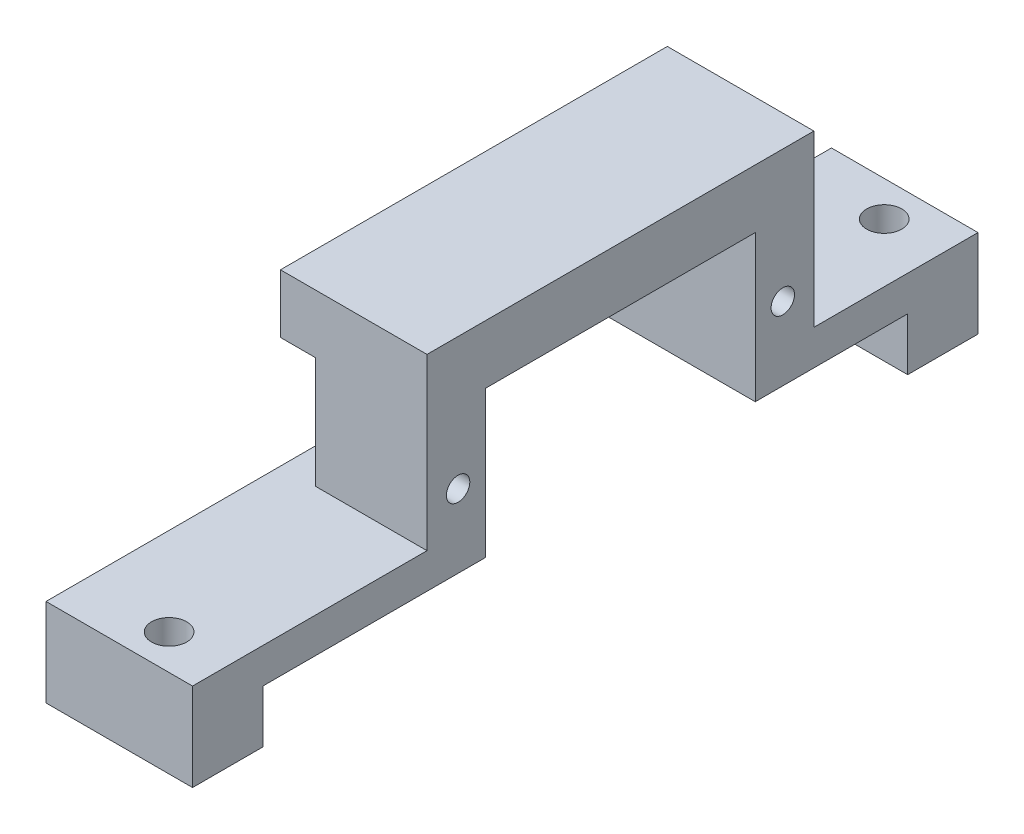
ISO-10303-21;
HEADER;
FILE_DESCRIPTION(('STEP AP214'),'2;1');
FILE_NAME('part.step','',(''),(''),'','','');
FILE_SCHEMA(('AUTOMOTIVE_DESIGN { 1 0 10303 214 1 1 1 1 }'));
ENDSEC;
DATA;
#1=APPLICATION_CONTEXT('core data for automotive mechanical design processes');
#2=APPLICATION_PROTOCOL_DEFINITION('international standard','automotive_design',2000,#1);
#3=PRODUCT_CONTEXT('',#1,'mechanical');
#4=PRODUCT('Part','Part','',(#3));
#5=PRODUCT_RELATED_PRODUCT_CATEGORY('part','',(#4));
#6=PRODUCT_DEFINITION_FORMATION('','',#4);
#7=PRODUCT_DEFINITION_CONTEXT('part definition',#1,'design');
#8=PRODUCT_DEFINITION('design','',#6,#7);
#9=PRODUCT_DEFINITION_SHAPE('','',#8);
#10=(LENGTH_UNIT() NAMED_UNIT(*) SI_UNIT(.MILLI.,.METRE.));
#11=(NAMED_UNIT(*) PLANE_ANGLE_UNIT() SI_UNIT($,.RADIAN.));
#12=(NAMED_UNIT(*) SI_UNIT($,.STERADIAN.) SOLID_ANGLE_UNIT());
#13=UNCERTAINTY_MEASURE_WITH_UNIT(LENGTH_MEASURE(1.E-05),#10,'distance_accuracy_value','');
#14=(GEOMETRIC_REPRESENTATION_CONTEXT(3) GLOBAL_UNCERTAINTY_ASSIGNED_CONTEXT((#13)) GLOBAL_UNIT_ASSIGNED_CONTEXT((#10,
#11,#12)) REPRESENTATION_CONTEXT('',''));
#15=CARTESIAN_POINT('',(0.,0.,0.));
#16=DIRECTION('',(0.,0.,1.));
#17=DIRECTION('',(1.,0.,0.));
#18=AXIS2_PLACEMENT_3D('',#15,#16,#17);
#19=CARTESIAN_POINT('',(0.,0.,0.));
#20=DIRECTION('',(1.,0.,0.));
#21=DIRECTION('',(0.,0.,-1.));
#22=AXIS2_PLACEMENT_3D('',#19,#20,#21);
#23=PLANE('',#22);
#24=DIRECTION('',(0.,0.,-1.));
#25=VECTOR('',#24,1.);
#26=CARTESIAN_POINT('',(0.,12.5,-25.));
#27=LINE('',#26,#25);
#28=CARTESIAN_POINT('',(0.,12.5,-20.));
#29=VERTEX_POINT('',#28);
#30=CARTESIAN_POINT('',(0.,12.5,-48.));
#31=VERTEX_POINT('',#30);
#32=EDGE_CURVE('E212',#29,#31,#27,.T.);
#33=ORIENTED_EDGE('',*,*,#32,.F.);
#34=DIRECTION('',(0.,-1.,0.));
#35=VECTOR('',#34,1.);
#36=CARTESIAN_POINT('',(0.,3.,-20.));
#37=LINE('',#36,#35);
#38=CARTESIAN_POINT('',(0.,17.5,-20.));
#39=VERTEX_POINT('',#38);
#40=EDGE_CURVE('E239',#39,#29,#37,.T.);
#41=ORIENTED_EDGE('',*,*,#40,.F.);
#42=DIRECTION('',(0.,0.,1.));
#43=VECTOR('',#42,1.);
#44=CARTESIAN_POINT('',(0.,17.5,-20.));
#45=LINE('',#44,#43);
#46=CARTESIAN_POINT('',(0.,17.5,-53.));
#47=VERTEX_POINT('',#46);
#48=EDGE_CURVE('E178',#47,#39,#45,.T.);
#49=ORIENTED_EDGE('',*,*,#48,.F.);
#50=DIRECTION('',(0.,1.,0.));
#51=VECTOR('',#50,1.);
#52=CARTESIAN_POINT('',(0.,17.5,-53.));
#53=LINE('',#52,#51);
#54=CARTESIAN_POINT('',(0.,3.,-53.));
#55=VERTEX_POINT('',#54);
#56=EDGE_CURVE('E234',#55,#47,#53,.T.);
#57=ORIENTED_EDGE('',*,*,#56,.F.);
#58=DIRECTION('',(0.,0.,1.));
#59=VECTOR('',#58,1.);
#60=CARTESIAN_POINT('',(0.,3.,-53.));
#61=LINE('',#60,#59);
#62=CARTESIAN_POINT('',(0.,3.,-67.));
#63=VERTEX_POINT('',#62);
#64=EDGE_CURVE('E231',#63,#55,#61,.T.);
#65=ORIENTED_EDGE('',*,*,#64,.F.);
#66=DIRECTION('',(0.,1.,0.));
#67=VECTOR('',#66,1.);
#68=CARTESIAN_POINT('',(0.,3.,-67.));
#69=LINE('',#68,#67);
#70=CARTESIAN_POINT('',(0.,-4.5,-67.));
#71=VERTEX_POINT('',#70);
#72=EDGE_CURVE('E228',#71,#63,#69,.T.);
#73=ORIENTED_EDGE('',*,*,#72,.F.);
#74=DIRECTION('',(0.,0.,-1.));
#75=VECTOR('',#74,1.);
#76=CARTESIAN_POINT('',(0.,-4.5,-61.));
#77=LINE('',#76,#75);
#78=CARTESIAN_POINT('',(0.,-4.5,-61.));
#79=VERTEX_POINT('',#78);
#80=EDGE_CURVE('E224',#79,#71,#77,.T.);
#81=ORIENTED_EDGE('',*,*,#80,.F.);
#82=DIRECTION('',(0.,-1.,0.));
#83=VECTOR('',#82,1.);
#84=CARTESIAN_POINT('',(0.,-4.5,-61.));
#85=LINE('',#84,#83);
#86=CARTESIAN_POINT('',(0.,0.,-61.));
#87=VERTEX_POINT('',#86);
#88=EDGE_CURVE('E221',#87,#79,#85,.T.);
#89=ORIENTED_EDGE('',*,*,#88,.F.);
#90=DIRECTION('',(0.,0.,-1.));
#91=VECTOR('',#90,1.);
#92=CARTESIAN_POINT('',(0.,0.,-48.));
#93=LINE('',#92,#91);
#94=CARTESIAN_POINT('',(0.,0.,-48.));
#95=VERTEX_POINT('',#94);
#96=EDGE_CURVE('E218',#95,#87,#93,.T.);
#97=ORIENTED_EDGE('',*,*,#96,.F.);
#98=DIRECTION('',(0.,-1.,0.));
#99=VECTOR('',#98,1.);
#100=CARTESIAN_POINT('',(0.,12.5,-48.));
#101=LINE('',#100,#99);
#102=EDGE_CURVE('E215',#31,#95,#101,.T.);
#103=ORIENTED_EDGE('',*,*,#102,.F.);
#104=EDGE_LOOP('',(#33,#41,#49,#57,#65,#73,#81,#89,#97,#103));
#105=FACE_BOUND('',#104,.T.);
#106=ADVANCED_FACE('F39',(#105),#23,.F.);
#107=CARTESIAN_POINT('',(12.5,-4.5,0.));
#108=DIRECTION('',(0.,1.,0.));
#109=DIRECTION('',(0.,0.,1.));
#110=AXIS2_PLACEMENT_3D('',#107,#108,#109);
#111=PLANE('',#110);
#112=CARTESIAN_POINT('',(7.5,-4.5,-3.));
#113=DIRECTION('',(0.,1.,0.));
#114=DIRECTION('',(0.,0.,1.));
#115=AXIS2_PLACEMENT_3D('',#112,#113,#114);
#116=CIRCLE('',#115,1.5);
#117=CARTESIAN_POINT('',(7.5,-4.5,-1.5));
#118=VERTEX_POINT('',#117);
#119=EDGE_CURVE('E495',#118,#118,#116,.T.);
#120=ORIENTED_EDGE('',*,*,#119,.T.);
#121=EDGE_LOOP('',(#120));
#122=FACE_BOUND('',#121,.T.);
#123=DIRECTION('',(0.,0.,-1.));
#124=VECTOR('',#123,1.);
#125=CARTESIAN_POINT('',(0.,-4.5,0.));
#126=LINE('',#125,#124);
#127=CARTESIAN_POINT('',(0.,-4.5,0.));
#128=VERTEX_POINT('',#127);
#129=CARTESIAN_POINT('',(0.,-4.5,-6.));
#130=VERTEX_POINT('',#129);
#131=EDGE_CURVE('E198',#128,#130,#126,.T.);
#132=ORIENTED_EDGE('',*,*,#131,.T.);
#133=DIRECTION('',(-1.,0.,0.));
#134=VECTOR('',#133,1.);
#135=CARTESIAN_POINT('',(12.5,-4.5,-6.));
#136=LINE('',#135,#134);
#137=CARTESIAN_POINT('',(12.5,-4.5,-6.));
#138=VERTEX_POINT('',#137);
#139=EDGE_CURVE('E48',#138,#130,#136,.T.);
#140=ORIENTED_EDGE('',*,*,#139,.F.);
#141=DIRECTION('',(0.,0.,-1.));
#142=VECTOR('',#141,1.);
#143=CARTESIAN_POINT('',(12.5,-4.5,0.));
#144=LINE('',#143,#142);
#145=CARTESIAN_POINT('',(12.5,-4.5,0.));
#146=VERTEX_POINT('',#145);
#147=EDGE_CURVE('E120',#146,#138,#144,.T.);
#148=ORIENTED_EDGE('',*,*,#147,.F.);
#149=DIRECTION('',(-1.,0.,0.));
#150=VECTOR('',#149,1.);
#151=CARTESIAN_POINT('',(12.5,-4.5,0.));
#152=LINE('',#151,#150);
#153=EDGE_CURVE('E11',#146,#128,#152,.T.);
#154=ORIENTED_EDGE('',*,*,#153,.T.);
#155=EDGE_LOOP('',(#132,#140,#148,#154));
#156=FACE_BOUND('',#155,.T.);
#157=ADVANCED_FACE('F41',(#122,#156),#111,.F.);
#158=CARTESIAN_POINT('',(12.5,-4.5,-6.));
#159=DIRECTION('',(0.,0.,1.));
#160=DIRECTION('',(1.,0.,0.));
#161=AXIS2_PLACEMENT_3D('',#158,#159,#160);
#162=PLANE('',#161);
#163=DIRECTION('',(0.,1.,0.));
#164=VECTOR('',#163,1.);
#165=CARTESIAN_POINT('',(0.,-4.5,-6.));
#166=LINE('',#165,#164);
#167=CARTESIAN_POINT('',(0.,0.,-6.));
#168=VERTEX_POINT('',#167);
#169=EDGE_CURVE('E201',#130,#168,#166,.T.);
#170=ORIENTED_EDGE('',*,*,#169,.T.);
#171=DIRECTION('',(-1.,0.,0.));
#172=VECTOR('',#171,1.);
#173=CARTESIAN_POINT('',(12.5,0.,-6.));
#174=LINE('',#173,#172);
#175=CARTESIAN_POINT('',(12.5,0.,-6.));
#176=VERTEX_POINT('',#175);
#177=EDGE_CURVE('E289',#176,#168,#174,.T.);
#178=ORIENTED_EDGE('',*,*,#177,.F.);
#179=DIRECTION('',(0.,1.,0.));
#180=VECTOR('',#179,1.);
#181=CARTESIAN_POINT('',(12.5,-4.5,-6.));
#182=LINE('',#181,#180);
#183=EDGE_CURVE('E299',#138,#176,#182,.T.);
#184=ORIENTED_EDGE('',*,*,#183,.F.);
#185=ORIENTED_EDGE('',*,*,#139,.T.);
#186=EDGE_LOOP('',(#170,#178,#184,#185));
#187=FACE_BOUND('',#186,.T.);
#188=ADVANCED_FACE('F297',(#187),#162,.F.);
#189=CARTESIAN_POINT('',(12.5,0.,-6.));
#190=DIRECTION('',(0.,1.,0.));
#191=DIRECTION('',(0.,0.,1.));
#192=AXIS2_PLACEMENT_3D('',#189,#190,#191);
#193=PLANE('',#192);
#194=DIRECTION('',(0.,0.,-1.));
#195=VECTOR('',#194,1.);
#196=CARTESIAN_POINT('',(0.,0.,-6.));
#197=LINE('',#196,#195);
#198=CARTESIAN_POINT('',(0.,0.,-25.));
#199=VERTEX_POINT('',#198);
#200=EDGE_CURVE('E205',#168,#199,#197,.T.);
#201=ORIENTED_EDGE('',*,*,#200,.T.);
#202=DIRECTION('',(-1.,0.,0.));
#203=VECTOR('',#202,1.);
#204=CARTESIAN_POINT('',(12.5,0.,-25.));
#205=LINE('',#204,#203);
#206=CARTESIAN_POINT('',(12.5,0.,-25.));
#207=VERTEX_POINT('',#206);
#208=EDGE_CURVE('E285',#207,#199,#205,.T.);
#209=ORIENTED_EDGE('',*,*,#208,.F.);
#210=DIRECTION('',(0.,0.,-1.));
#211=VECTOR('',#210,1.);
#212=CARTESIAN_POINT('',(12.5,0.,-6.));
#213=LINE('',#212,#211);
#214=EDGE_CURVE('E317',#176,#207,#213,.T.);
#215=ORIENTED_EDGE('',*,*,#214,.F.);
#216=ORIENTED_EDGE('',*,*,#177,.T.);
#217=EDGE_LOOP('',(#201,#209,#215,#216));
#218=FACE_BOUND('',#217,.T.);
#219=ADVANCED_FACE('F305',(#218),#193,.F.);
#220=CARTESIAN_POINT('',(12.5,0.,-25.));
#221=DIRECTION('',(0.,0.,1.));
#222=DIRECTION('',(0.,-1.,0.));
#223=AXIS2_PLACEMENT_3D('',#220,#221,#222);
#224=PLANE('',#223);
#225=DIRECTION('',(1.,0.,0.));
#226=VECTOR('',#225,1.);
#227=CARTESIAN_POINT('',(0.,3.,-25.));
#228=LINE('',#227,#226);
#229=CARTESIAN_POINT('',(0.,3.,-25.));
#230=VERTEX_POINT('',#229);
#231=CARTESIAN_POINT('',(3.,3.,-25.));
#232=VERTEX_POINT('',#231);
#233=EDGE_CURVE('E381',#230,#232,#228,.T.);
#234=ORIENTED_EDGE('',*,*,#233,.T.);
#235=DIRECTION('',(0.,1.,0.));
#236=VECTOR('',#235,1.);
#237=CARTESIAN_POINT('',(3.,3.,-25.));
#238=LINE('',#237,#236);
#239=CARTESIAN_POINT('',(3.,12.5,-25.));
#240=VERTEX_POINT('',#239);
#241=EDGE_CURVE('E375',#232,#240,#238,.T.);
#242=ORIENTED_EDGE('',*,*,#241,.T.);
#243=DIRECTION('',(-1.,0.,0.));
#244=VECTOR('',#243,1.);
#245=CARTESIAN_POINT('',(12.5,12.5,-25.));
#246=LINE('',#245,#244);
#247=CARTESIAN_POINT('',(12.5,12.5,-25.));
#248=VERTEX_POINT('',#247);
#249=EDGE_CURVE('E281',#248,#240,#246,.T.);
#250=ORIENTED_EDGE('',*,*,#249,.F.);
#251=DIRECTION('',(0.,1.,0.));
#252=VECTOR('',#251,1.);
#253=CARTESIAN_POINT('',(12.5,0.,-25.));
#254=LINE('',#253,#252);
#255=EDGE_CURVE('E312',#207,#248,#254,.T.);
#256=ORIENTED_EDGE('',*,*,#255,.F.);
#257=ORIENTED_EDGE('',*,*,#208,.T.);
#258=DIRECTION('',(0.,1.,0.));
#259=VECTOR('',#258,1.);
#260=CARTESIAN_POINT('',(0.,0.,-25.));
#261=LINE('',#260,#259);
#262=EDGE_CURVE('E208',#199,#230,#261,.T.);
#263=ORIENTED_EDGE('',*,*,#262,.T.);
#264=EDGE_LOOP('',(#234,#242,#250,#256,#257,#263));
#265=FACE_BOUND('',#264,.T.);
#266=ADVANCED_FACE('F310',(#265),#224,.F.);
#267=CARTESIAN_POINT('',(12.5,12.5,-25.));
#268=DIRECTION('',(0.,1.,0.));
#269=DIRECTION('',(0.,0.,1.));
#270=AXIS2_PLACEMENT_3D('',#267,#268,#269);
#271=PLANE('',#270);
#272=ORIENTED_EDGE('',*,*,#32,.T.);
#273=DIRECTION('',(-1.,0.,0.));
#274=VECTOR('',#273,1.);
#275=CARTESIAN_POINT('',(12.5,12.5,-48.));
#276=LINE('',#275,#274);
#277=CARTESIAN_POINT('',(12.5,12.5,-48.));
#278=VERTEX_POINT('',#277);
#279=EDGE_CURVE('E277',#278,#31,#276,.T.);
#280=ORIENTED_EDGE('',*,*,#279,.F.);
#281=DIRECTION('',(0.,0.,-1.));
#282=VECTOR('',#281,1.);
#283=CARTESIAN_POINT('',(12.5,12.5,-25.));
#284=LINE('',#283,#282);
#285=EDGE_CURVE('E316',#248,#278,#284,.T.);
#286=ORIENTED_EDGE('',*,*,#285,.F.);
#287=ORIENTED_EDGE('',*,*,#249,.T.);
#288=DIRECTION('',(0.,0.,1.));
#289=VECTOR('',#288,1.);
#290=CARTESIAN_POINT('',(3.,12.5,-25.));
#291=LINE('',#290,#289);
#292=CARTESIAN_POINT('',(3.,12.5,-20.));
#293=VERTEX_POINT('',#292);
#294=EDGE_CURVE('E367',#240,#293,#291,.T.);
#295=ORIENTED_EDGE('',*,*,#294,.T.);
#296=DIRECTION('',(-1.,0.,0.));
#297=VECTOR('',#296,1.);
#298=CARTESIAN_POINT('',(0.,12.5,-20.));
#299=LINE('',#298,#297);
#300=EDGE_CURVE('E359',#293,#29,#299,.T.);
#301=ORIENTED_EDGE('',*,*,#300,.T.);
#302=EDGE_LOOP('',(#272,#280,#286,#287,#295,#301));
#303=FACE_BOUND('',#302,.T.);
#304=ADVANCED_FACE('F384',(#303),#271,.F.);
#305=CARTESIAN_POINT('',(12.5,12.5,-48.));
#306=DIRECTION('',(0.,0.,-1.));
#307=DIRECTION('',(-1.,0.,0.));
#308=AXIS2_PLACEMENT_3D('',#305,#306,#307);
#309=PLANE('',#308);
#310=ORIENTED_EDGE('',*,*,#102,.T.);
#311=DIRECTION('',(-1.,0.,0.));
#312=VECTOR('',#311,1.);
#313=CARTESIAN_POINT('',(12.5,0.,-48.));
#314=LINE('',#313,#312);
#315=CARTESIAN_POINT('',(12.5,0.,-48.));
#316=VERTEX_POINT('',#315);
#317=EDGE_CURVE('E273',#316,#95,#314,.T.);
#318=ORIENTED_EDGE('',*,*,#317,.F.);
#319=DIRECTION('',(0.,-1.,0.));
#320=VECTOR('',#319,1.);
#321=CARTESIAN_POINT('',(12.5,12.5,-48.));
#322=LINE('',#321,#320);
#323=EDGE_CURVE('E321',#278,#316,#322,.T.);
#324=ORIENTED_EDGE('',*,*,#323,.F.);
#325=ORIENTED_EDGE('',*,*,#279,.T.);
#326=EDGE_LOOP('',(#310,#318,#324,#325));
#327=FACE_BOUND('',#326,.T.);
#328=ADVANCED_FACE('F391',(#327),#309,.F.);
#329=CARTESIAN_POINT('',(12.5,0.,-48.));
#330=DIRECTION('',(0.,1.,0.));
#331=DIRECTION('',(0.,0.,1.));
#332=AXIS2_PLACEMENT_3D('',#329,#330,#331);
#333=PLANE('',#332);
#334=ORIENTED_EDGE('',*,*,#96,.T.);
#335=DIRECTION('',(-1.,0.,0.));
#336=VECTOR('',#335,1.);
#337=CARTESIAN_POINT('',(12.5,0.,-61.));
#338=LINE('',#337,#336);
#339=CARTESIAN_POINT('',(12.5,0.,-61.));
#340=VERTEX_POINT('',#339);
#341=EDGE_CURVE('E269',#340,#87,#338,.T.);
#342=ORIENTED_EDGE('',*,*,#341,.F.);
#343=DIRECTION('',(0.,0.,-1.));
#344=VECTOR('',#343,1.);
#345=CARTESIAN_POINT('',(12.5,0.,-48.));
#346=LINE('',#345,#344);
#347=EDGE_CURVE('E328',#316,#340,#346,.T.);
#348=ORIENTED_EDGE('',*,*,#347,.F.);
#349=ORIENTED_EDGE('',*,*,#317,.T.);
#350=EDGE_LOOP('',(#334,#342,#348,#349));
#351=FACE_BOUND('',#350,.T.);
#352=ADVANCED_FACE('F394',(#351),#333,.F.);
#353=CARTESIAN_POINT('',(12.5,-4.5,-61.));
#354=DIRECTION('',(0.,0.,-1.));
#355=DIRECTION('',(-1.,0.,0.));
#356=AXIS2_PLACEMENT_3D('',#353,#354,#355);
#357=PLANE('',#356);
#358=ORIENTED_EDGE('',*,*,#88,.T.);
#359=DIRECTION('',(-1.,0.,0.));
#360=VECTOR('',#359,1.);
#361=CARTESIAN_POINT('',(12.5,-4.5,-61.));
#362=LINE('',#361,#360);
#363=CARTESIAN_POINT('',(12.5,-4.5,-61.));
#364=VERTEX_POINT('',#363);
#365=EDGE_CURVE('E265',#364,#79,#362,.T.);
#366=ORIENTED_EDGE('',*,*,#365,.F.);
#367=DIRECTION('',(0.,-1.,0.));
#368=VECTOR('',#367,1.);
#369=CARTESIAN_POINT('',(12.5,-4.5,-61.));
#370=LINE('',#369,#368);
#371=EDGE_CURVE('E331',#340,#364,#370,.T.);
#372=ORIENTED_EDGE('',*,*,#371,.F.);
#373=ORIENTED_EDGE('',*,*,#341,.T.);
#374=EDGE_LOOP('',(#358,#366,#372,#373));
#375=FACE_BOUND('',#374,.T.);
#376=ADVANCED_FACE('F399',(#375),#357,.F.);
#377=CARTESIAN_POINT('',(12.5,-4.5,-61.));
#378=DIRECTION('',(0.,1.,0.));
#379=DIRECTION('',(0.,0.,1.));
#380=AXIS2_PLACEMENT_3D('',#377,#378,#379);
#381=PLANE('',#380);
#382=CARTESIAN_POINT('',(7.5,-4.5,-64.));
#383=DIRECTION('',(0.,1.,0.));
#384=DIRECTION('',(0.,0.,1.));
#385=AXIS2_PLACEMENT_3D('',#382,#383,#384);
#386=CIRCLE('',#385,1.5);
#387=CARTESIAN_POINT('',(7.5,-4.5,-62.5));
#388=VERTEX_POINT('',#387);
#389=EDGE_CURVE('E202',#388,#388,#386,.T.);
#390=ORIENTED_EDGE('',*,*,#389,.T.);
#391=EDGE_LOOP('',(#390));
#392=FACE_BOUND('',#391,.T.);
#393=ORIENTED_EDGE('',*,*,#80,.T.);
#394=DIRECTION('',(-1.,0.,0.));
#395=VECTOR('',#394,1.);
#396=CARTESIAN_POINT('',(12.5,-4.5,-67.));
#397=LINE('',#396,#395);
#398=CARTESIAN_POINT('',(12.5,-4.5,-67.));
#399=VERTEX_POINT('',#398);
#400=EDGE_CURVE('E261',#399,#71,#397,.T.);
#401=ORIENTED_EDGE('',*,*,#400,.F.);
#402=DIRECTION('',(0.,0.,-1.));
#403=VECTOR('',#402,1.);
#404=CARTESIAN_POINT('',(12.5,-4.5,-61.));
#405=LINE('',#404,#403);
#406=EDGE_CURVE('E334',#364,#399,#405,.T.);
#407=ORIENTED_EDGE('',*,*,#406,.F.);
#408=ORIENTED_EDGE('',*,*,#365,.T.);
#409=EDGE_LOOP('',(#393,#401,#407,#408));
#410=FACE_BOUND('',#409,.T.);
#411=ADVANCED_FACE('F403',(#392,#410),#381,.F.);
#412=CARTESIAN_POINT('',(12.5,3.,-67.));
#413=DIRECTION('',(0.,0.,1.));
#414=DIRECTION('',(1.,0.,0.));
#415=AXIS2_PLACEMENT_3D('',#412,#413,#414);
#416=PLANE('',#415);
#417=ORIENTED_EDGE('',*,*,#72,.T.);
#418=DIRECTION('',(-1.,0.,0.));
#419=VECTOR('',#418,1.);
#420=CARTESIAN_POINT('',(12.5,3.,-67.));
#421=LINE('',#420,#419);
#422=CARTESIAN_POINT('',(12.5,3.,-67.));
#423=VERTEX_POINT('',#422);
#424=EDGE_CURVE('E257',#423,#63,#421,.T.);
#425=ORIENTED_EDGE('',*,*,#424,.F.);
#426=DIRECTION('',(0.,1.,0.));
#427=VECTOR('',#426,1.);
#428=CARTESIAN_POINT('',(12.5,-4.5,-67.));
#429=LINE('',#428,#427);
#430=EDGE_CURVE('E337',#399,#423,#429,.T.);
#431=ORIENTED_EDGE('',*,*,#430,.F.);
#432=ORIENTED_EDGE('',*,*,#400,.T.);
#433=EDGE_LOOP('',(#417,#425,#431,#432));
#434=FACE_BOUND('',#433,.T.);
#435=ADVANCED_FACE('F406',(#434),#416,.F.);
#436=CARTESIAN_POINT('',(12.5,3.,-53.));
#437=DIRECTION('',(0.,-1.,0.));
#438=DIRECTION('',(0.,0.,-1.));
#439=AXIS2_PLACEMENT_3D('',#436,#437,#438);
#440=PLANE('',#439);
#441=CARTESIAN_POINT('',(7.5,3.,-64.));
#442=DIRECTION('',(0.,1.,0.));
#443=DIRECTION('',(0.,0.,-1.));
#444=AXIS2_PLACEMENT_3D('',#441,#442,#443);
#445=CIRCLE('',#444,1.5);
#446=CARTESIAN_POINT('',(7.5,3.,-65.5));
#447=VERTEX_POINT('',#446);
#448=EDGE_CURVE('E378',#447,#447,#445,.T.);
#449=ORIENTED_EDGE('',*,*,#448,.F.);
#450=EDGE_LOOP('',(#449));
#451=FACE_BOUND('',#450,.T.);
#452=ORIENTED_EDGE('',*,*,#64,.T.);
#453=DIRECTION('',(-1.,0.,0.));
#454=VECTOR('',#453,1.);
#455=CARTESIAN_POINT('',(12.5,3.,-53.));
#456=LINE('',#455,#454);
#457=CARTESIAN_POINT('',(12.5,3.,-53.));
#458=VERTEX_POINT('',#457);
#459=EDGE_CURVE('E253',#458,#55,#456,.T.);
#460=ORIENTED_EDGE('',*,*,#459,.F.);
#461=DIRECTION('',(0.,0.,1.));
#462=VECTOR('',#461,1.);
#463=CARTESIAN_POINT('',(12.5,3.,-53.));
#464=LINE('',#463,#462);
#465=EDGE_CURVE('E340',#423,#458,#464,.T.);
#466=ORIENTED_EDGE('',*,*,#465,.F.);
#467=ORIENTED_EDGE('',*,*,#424,.T.);
#468=EDGE_LOOP('',(#452,#460,#466,#467));
#469=FACE_BOUND('',#468,.T.);
#470=ADVANCED_FACE('F348',(#451,#469),#440,.F.);
#471=CARTESIAN_POINT('',(12.5,17.5,-53.));
#472=DIRECTION('',(0.,0.,1.));
#473=DIRECTION('',(1.,0.,0.));
#474=AXIS2_PLACEMENT_3D('',#471,#472,#473);
#475=PLANE('',#474);
#476=ORIENTED_EDGE('',*,*,#56,.T.);
#477=DIRECTION('',(-1.,0.,0.));
#478=VECTOR('',#477,1.);
#479=CARTESIAN_POINT('',(12.5,17.5,-53.));
#480=LINE('',#479,#478);
#481=CARTESIAN_POINT('',(12.5,17.5,-53.));
#482=VERTEX_POINT('',#481);
#483=EDGE_CURVE('E183',#482,#47,#480,.T.);
#484=ORIENTED_EDGE('',*,*,#483,.F.);
#485=DIRECTION('',(0.,1.,0.));
#486=VECTOR('',#485,1.);
#487=CARTESIAN_POINT('',(12.5,17.5,-53.));
#488=LINE('',#487,#486);
#489=EDGE_CURVE('E168',#458,#482,#488,.T.);
#490=ORIENTED_EDGE('',*,*,#489,.F.);
#491=ORIENTED_EDGE('',*,*,#459,.T.);
#492=EDGE_LOOP('',(#476,#484,#490,#491));
#493=FACE_BOUND('',#492,.T.);
#494=ADVANCED_FACE('F352',(#493),#475,.F.);
#495=CARTESIAN_POINT('',(12.5,17.5,-20.));
#496=DIRECTION('',(0.,-1.,0.));
#497=DIRECTION('',(0.,0.,-1.));
#498=AXIS2_PLACEMENT_3D('',#495,#496,#497);
#499=PLANE('',#498);
#500=ORIENTED_EDGE('',*,*,#48,.T.);
#501=DIRECTION('',(-1.,0.,0.));
#502=VECTOR('',#501,1.);
#503=CARTESIAN_POINT('',(12.5,17.5,-20.));
#504=LINE('',#503,#502);
#505=CARTESIAN_POINT('',(12.5,17.5,-20.));
#506=VERTEX_POINT('',#505);
#507=EDGE_CURVE('E175',#506,#39,#504,.T.);
#508=ORIENTED_EDGE('',*,*,#507,.F.);
#509=DIRECTION('',(0.,0.,1.));
#510=VECTOR('',#509,1.);
#511=CARTESIAN_POINT('',(12.5,17.5,-20.));
#512=LINE('',#511,#510);
#513=EDGE_CURVE('E161',#482,#506,#512,.T.);
#514=ORIENTED_EDGE('',*,*,#513,.F.);
#515=ORIENTED_EDGE('',*,*,#483,.T.);
#516=EDGE_LOOP('',(#500,#508,#514,#515));
#517=FACE_BOUND('',#516,.T.);
#518=ADVANCED_FACE('F176',(#517),#499,.F.);
#519=CARTESIAN_POINT('',(12.5,3.,-20.));
#520=DIRECTION('',(0.,0.,-1.));
#521=DIRECTION('',(-1.,0.,0.));
#522=AXIS2_PLACEMENT_3D('',#519,#520,#521);
#523=PLANE('',#522);
#524=ORIENTED_EDGE('',*,*,#40,.T.);
#525=ORIENTED_EDGE('',*,*,#300,.F.);
#526=DIRECTION('',(0.,1.,0.));
#527=VECTOR('',#526,1.);
#528=CARTESIAN_POINT('',(3.,3.,-20.));
#529=LINE('',#528,#527);
#530=CARTESIAN_POINT('',(3.,3.,-20.));
#531=VERTEX_POINT('',#530);
#532=EDGE_CURVE('E376',#531,#293,#529,.T.);
#533=ORIENTED_EDGE('',*,*,#532,.F.);
#534=DIRECTION('',(-1.,0.,0.));
#535=VECTOR('',#534,1.);
#536=CARTESIAN_POINT('',(12.5,3.,-20.));
#537=LINE('',#536,#535);
#538=CARTESIAN_POINT('',(12.5,3.,-20.));
#539=VERTEX_POINT('',#538);
#540=EDGE_CURVE('E184',#539,#531,#537,.T.);
#541=ORIENTED_EDGE('',*,*,#540,.F.);
#542=DIRECTION('',(0.,-1.,0.));
#543=VECTOR('',#542,1.);
#544=CARTESIAN_POINT('',(12.5,3.,-20.));
#545=LINE('',#544,#543);
#546=EDGE_CURVE('E165',#506,#539,#545,.T.);
#547=ORIENTED_EDGE('',*,*,#546,.F.);
#548=ORIENTED_EDGE('',*,*,#507,.T.);
#549=EDGE_LOOP('',(#524,#525,#533,#541,#547,#548));
#550=FACE_BOUND('',#549,.T.);
#551=ADVANCED_FACE('F186',(#550),#523,.F.);
#552=CARTESIAN_POINT('',(12.5,3.,0.));
#553=DIRECTION('',(0.,-1.,0.));
#554=DIRECTION('',(0.,0.,-1.));
#555=AXIS2_PLACEMENT_3D('',#552,#553,#554);
#556=PLANE('',#555);
#557=CARTESIAN_POINT('',(7.5,3.,-3.));
#558=DIRECTION('',(0.,1.,0.));
#559=DIRECTION('',(0.,0.,1.));
#560=AXIS2_PLACEMENT_3D('',#557,#558,#559);
#561=CIRCLE('',#560,1.5);
#562=CARTESIAN_POINT('',(7.5,3.,-1.5));
#563=VERTEX_POINT('',#562);
#564=EDGE_CURVE('E491',#563,#563,#561,.T.);
#565=ORIENTED_EDGE('',*,*,#564,.F.);
#566=EDGE_LOOP('',(#565));
#567=FACE_BOUND('',#566,.T.);
#568=DIRECTION('',(0.,0.,1.));
#569=VECTOR('',#568,1.);
#570=CARTESIAN_POINT('',(0.,3.,0.));
#571=LINE('',#570,#569);
#572=CARTESIAN_POINT('',(0.,3.,0.));
#573=VERTEX_POINT('',#572);
#574=EDGE_CURVE('E55',#230,#573,#571,.T.);
#575=ORIENTED_EDGE('',*,*,#574,.T.);
#576=DIRECTION('',(-1.,0.,0.));
#577=VECTOR('',#576,1.);
#578=CARTESIAN_POINT('',(12.5,3.,0.));
#579=LINE('',#578,#577);
#580=CARTESIAN_POINT('',(12.5,3.,0.));
#581=VERTEX_POINT('',#580);
#582=EDGE_CURVE('E194',#581,#573,#579,.T.);
#583=ORIENTED_EDGE('',*,*,#582,.F.);
#584=DIRECTION('',(0.,0.,1.));
#585=VECTOR('',#584,1.);
#586=CARTESIAN_POINT('',(12.5,3.,0.));
#587=LINE('',#586,#585);
#588=EDGE_CURVE('E191',#539,#581,#587,.T.);
#589=ORIENTED_EDGE('',*,*,#588,.F.);
#590=ORIENTED_EDGE('',*,*,#540,.T.);
#591=DIRECTION('',(0.,0.,1.));
#592=VECTOR('',#591,1.);
#593=CARTESIAN_POINT('',(3.,3.,-25.));
#594=LINE('',#593,#592);
#595=EDGE_CURVE('E379',#232,#531,#594,.T.);
#596=ORIENTED_EDGE('',*,*,#595,.F.);
#597=ORIENTED_EDGE('',*,*,#233,.F.);
#598=EDGE_LOOP('',(#575,#583,#589,#590,#596,#597));
#599=FACE_BOUND('',#598,.T.);
#600=ADVANCED_FACE('F439',(#567,#599),#556,.F.);
#601=CARTESIAN_POINT('',(12.5,3.,0.));
#602=DIRECTION('',(0.,0.,-1.));
#603=DIRECTION('',(-1.,0.,0.));
#604=AXIS2_PLACEMENT_3D('',#601,#602,#603);
#605=PLANE('',#604);
#606=DIRECTION('',(0.,-1.,0.));
#607=VECTOR('',#606,1.);
#608=CARTESIAN_POINT('',(0.,3.,0.));
#609=LINE('',#608,#607);
#610=EDGE_CURVE('E244',#573,#128,#609,.T.);
#611=ORIENTED_EDGE('',*,*,#610,.T.);
#612=ORIENTED_EDGE('',*,*,#153,.F.);
#613=DIRECTION('',(0.,-1.,0.));
#614=VECTOR('',#613,1.);
#615=CARTESIAN_POINT('',(12.5,0.,0.));
#616=LINE('',#615,#614);
#617=EDGE_CURVE('E64',#581,#146,#616,.T.);
#618=ORIENTED_EDGE('',*,*,#617,.F.);
#619=ORIENTED_EDGE('',*,*,#582,.T.);
#620=EDGE_LOOP('',(#611,#612,#618,#619));
#621=FACE_BOUND('',#620,.T.);
#622=ADVANCED_FACE('F434',(#621),#605,.F.);
#623=CARTESIAN_POINT('',(12.5,0.,0.));
#624=DIRECTION('',(1.,0.,0.));
#625=DIRECTION('',(0.,0.,-1.));
#626=AXIS2_PLACEMENT_3D('',#623,#624,#625);
#627=PLANE('',#626);
#628=CARTESIAN_POINT('',(12.5,6.25,-22.65));
#629=DIRECTION('',(1.,0.,0.));
#630=DIRECTION('',(0.,0.,-1.));
#631=AXIS2_PLACEMENT_3D('',#628,#629,#630);
#632=CIRCLE('',#631,1.);
#633=CARTESIAN_POINT('',(12.5,6.25,-23.65));
#634=VERTEX_POINT('',#633);
#635=EDGE_CURVE('E469',#634,#634,#632,.T.);
#636=ORIENTED_EDGE('',*,*,#635,.F.);
#637=EDGE_LOOP('',(#636));
#638=FACE_BOUND('',#637,.T.);
#639=CARTESIAN_POINT('',(12.5,6.25,-50.35));
#640=DIRECTION('',(1.,0.,0.));
#641=DIRECTION('',(0.,0.,1.));
#642=AXIS2_PLACEMENT_3D('',#639,#640,#641);
#643=CIRCLE('',#642,0.999999999999998);
#644=CARTESIAN_POINT('',(12.5,6.25,-49.35));
#645=VERTEX_POINT('',#644);
#646=EDGE_CURVE('E481',#645,#645,#643,.T.);
#647=ORIENTED_EDGE('',*,*,#646,.F.);
#648=EDGE_LOOP('',(#647));
#649=FACE_BOUND('',#648,.T.);
#650=ORIENTED_EDGE('',*,*,#617,.T.);
#651=ORIENTED_EDGE('',*,*,#147,.T.);
#652=ORIENTED_EDGE('',*,*,#183,.T.);
#653=ORIENTED_EDGE('',*,*,#214,.T.);
#654=ORIENTED_EDGE('',*,*,#255,.T.);
#655=ORIENTED_EDGE('',*,*,#285,.T.);
#656=ORIENTED_EDGE('',*,*,#323,.T.);
#657=ORIENTED_EDGE('',*,*,#347,.T.);
#658=ORIENTED_EDGE('',*,*,#371,.T.);
#659=ORIENTED_EDGE('',*,*,#406,.T.);
#660=ORIENTED_EDGE('',*,*,#430,.T.);
#661=ORIENTED_EDGE('',*,*,#465,.T.);
#662=ORIENTED_EDGE('',*,*,#489,.T.);
#663=ORIENTED_EDGE('',*,*,#513,.T.);
#664=ORIENTED_EDGE('',*,*,#546,.T.);
#665=ORIENTED_EDGE('',*,*,#588,.T.);
#666=EDGE_LOOP('',(#650,#651,#652,#653,#654,#655,#656,#657,#658,#659,#660,#661,#662,#663,#664,#665));
#667=FACE_BOUND('',#666,.T.);
#668=ADVANCED_FACE('F163',(#638,#649,#667),#627,.T.);
#669=ORIENTED_EDGE('',*,*,#574,.F.);
#670=ORIENTED_EDGE('',*,*,#262,.F.);
#671=ORIENTED_EDGE('',*,*,#200,.F.);
#672=ORIENTED_EDGE('',*,*,#169,.F.);
#673=ORIENTED_EDGE('',*,*,#131,.F.);
#674=ORIENTED_EDGE('',*,*,#610,.F.);
#675=EDGE_LOOP('',(#669,#670,#671,#672,#673,#674));
#676=FACE_BOUND('',#675,.T.);
#677=ADVANCED_FACE('F302',(#676),#23,.F.);
#678=CARTESIAN_POINT('',(7.5,-9.5,-3.));
#679=DIRECTION('',(0.,1.,0.));
#680=DIRECTION('',(0.,0.,1.));
#681=AXIS2_PLACEMENT_3D('',#678,#679,#680);
#682=CYLINDRICAL_SURFACE('',#681,1.5);
#683=ORIENTED_EDGE('',*,*,#564,.T.);
#684=EDGE_LOOP('',(#683));
#685=FACE_BOUND('',#684,.T.);
#686=ORIENTED_EDGE('',*,*,#119,.F.);
#687=EDGE_LOOP('',(#686));
#688=FACE_BOUND('',#687,.T.);
#689=ADVANCED_FACE('F426',(#685,#688),#682,.F.);
#690=CARTESIAN_POINT('',(7.5,-9.5,-64.));
#691=DIRECTION('',(0.,1.,0.));
#692=DIRECTION('',(0.,0.,1.));
#693=AXIS2_PLACEMENT_3D('',#690,#691,#692);
#694=CYLINDRICAL_SURFACE('',#693,1.5);
#695=ORIENTED_EDGE('',*,*,#448,.T.);
#696=EDGE_LOOP('',(#695));
#697=FACE_BOUND('',#696,.T.);
#698=ORIENTED_EDGE('',*,*,#389,.F.);
#699=EDGE_LOOP('',(#698));
#700=FACE_BOUND('',#699,.T.);
#701=ADVANCED_FACE('F431',(#697,#700),#694,.F.);
#702=CARTESIAN_POINT('',(3.,3.,-25.));
#703=DIRECTION('',(1.,0.,0.));
#704=DIRECTION('',(0.,0.,-1.));
#705=AXIS2_PLACEMENT_3D('',#702,#703,#704);
#706=PLANE('',#705);
#707=ORIENTED_EDGE('',*,*,#532,.T.);
#708=ORIENTED_EDGE('',*,*,#294,.F.);
#709=ORIENTED_EDGE('',*,*,#241,.F.);
#710=ORIENTED_EDGE('',*,*,#595,.T.);
#711=EDGE_LOOP('',(#707,#708,#709,#710));
#712=FACE_BOUND('',#711,.T.);
#713=ADVANCED_FACE('F374',(#712),#706,.F.);
#714=CARTESIAN_POINT('',(9.5,6.25,-50.35));
#715=DIRECTION('',(1.,0.,0.));
#716=DIRECTION('',(0.,0.,-1.));
#717=AXIS2_PLACEMENT_3D('',#714,#715,#716);
#718=CYLINDRICAL_SURFACE('',#717,0.999999999999998);
#719=CARTESIAN_POINT('',(9.5,6.25,-50.35));
#720=DIRECTION('',(1.,0.,0.));
#721=DIRECTION('',(0.,0.,1.));
#722=AXIS2_PLACEMENT_3D('',#719,#720,#721);
#723=CIRCLE('',#722,0.999999999999998);
#724=CARTESIAN_POINT('',(9.5,6.25,-49.35));
#725=VERTEX_POINT('',#724);
#726=EDGE_CURVE('E475',#725,#725,#723,.T.);
#727=ORIENTED_EDGE('',*,*,#726,.F.);
#728=EDGE_LOOP('',(#727));
#729=FACE_BOUND('',#728,.T.);
#730=ORIENTED_EDGE('',*,*,#646,.T.);
#731=EDGE_LOOP('',(#730));
#732=FACE_BOUND('',#731,.T.);
#733=ADVANCED_FACE('F448',(#729,#732),#718,.F.);
#734=CARTESIAN_POINT('',(9.5,6.25,-50.35));
#735=DIRECTION('',(-1.,0.,0.));
#736=DIRECTION('',(0.,0.,1.));
#737=AXIS2_PLACEMENT_3D('',#734,#735,#736);
#738=PLANE('',#737);
#739=ORIENTED_EDGE('',*,*,#726,.T.);
#740=EDGE_LOOP('',(#739));
#741=FACE_BOUND('',#740,.T.);
#742=ADVANCED_FACE('F451',(#741),#738,.F.);
#743=CARTESIAN_POINT('',(9.5,6.25,-22.65));
#744=DIRECTION('',(1.,0.,0.));
#745=DIRECTION('',(0.,0.,-1.));
#746=AXIS2_PLACEMENT_3D('',#743,#744,#745);
#747=CYLINDRICAL_SURFACE('',#746,1.);
#748=CARTESIAN_POINT('',(9.5,6.25,-22.65));
#749=DIRECTION('',(1.,0.,0.));
#750=DIRECTION('',(0.,0.,-1.));
#751=AXIS2_PLACEMENT_3D('',#748,#749,#750);
#752=CIRCLE('',#751,1.);
#753=CARTESIAN_POINT('',(9.5,6.25,-23.65));
#754=VERTEX_POINT('',#753);
#755=EDGE_CURVE('E467',#754,#754,#752,.T.);
#756=ORIENTED_EDGE('',*,*,#755,.F.);
#757=EDGE_LOOP('',(#756));
#758=FACE_BOUND('',#757,.T.);
#759=ORIENTED_EDGE('',*,*,#635,.T.);
#760=EDGE_LOOP('',(#759));
#761=FACE_BOUND('',#760,.T.);
#762=ADVANCED_FACE('F455',(#758,#761),#747,.F.);
#763=CARTESIAN_POINT('',(9.5,6.25,-22.65));
#764=DIRECTION('',(1.,0.,0.));
#765=DIRECTION('',(0.,0.,-1.));
#766=AXIS2_PLACEMENT_3D('',#763,#764,#765);
#767=PLANE('',#766);
#768=ORIENTED_EDGE('',*,*,#755,.T.);
#769=EDGE_LOOP('',(#768));
#770=FACE_BOUND('',#769,.T.);
#771=ADVANCED_FACE('F459',(#770),#767,.T.);
#772=CLOSED_SHELL('',(#106,#157,#188,#219,#266,#304,#328,#352,#376,#411,#435,#470,#494,#518,
#551,#600,#622,#668,#677,#689,#701,#713,#733,#742,#762,#771));
#773=MANIFOLD_SOLID_BREP('B2',#772);
#774=ADVANCED_BREP_SHAPE_REPRESENTATION('',(#18,#773),#14);
#775=SHAPE_DEFINITION_REPRESENTATION(#9,#774);
ENDSEC;
END-ISO-10303-21;
